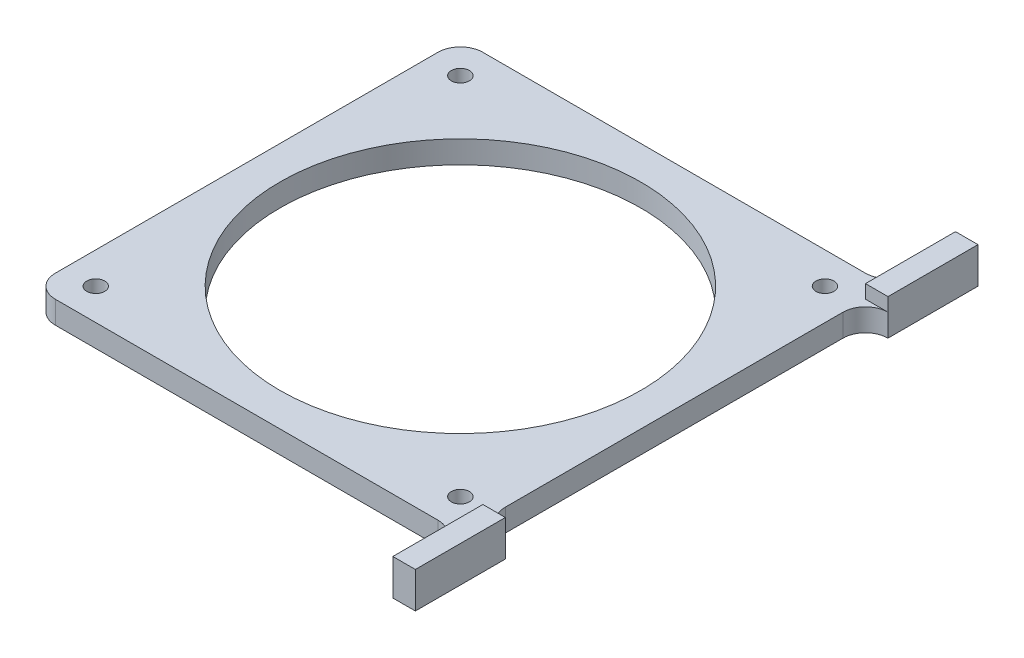
ISO-10303-21;
HEADER;
FILE_DESCRIPTION(('STEP AP214'),'2;1');
FILE_NAME('part.step','',(''),(''),'','','');
FILE_SCHEMA(('AUTOMOTIVE_DESIGN { 1 0 10303 214 1 1 1 1 }'));
ENDSEC;
DATA;
#1=APPLICATION_CONTEXT('core data for automotive mechanical design processes');
#2=APPLICATION_PROTOCOL_DEFINITION('international standard','automotive_design',2000,#1);
#3=PRODUCT_CONTEXT('',#1,'mechanical');
#4=PRODUCT('Part','Part','',(#3));
#5=PRODUCT_RELATED_PRODUCT_CATEGORY('part','',(#4));
#6=PRODUCT_DEFINITION_FORMATION('','',#4);
#7=PRODUCT_DEFINITION_CONTEXT('part definition',#1,'design');
#8=PRODUCT_DEFINITION('design','',#6,#7);
#9=PRODUCT_DEFINITION_SHAPE('','',#8);
#10=(LENGTH_UNIT() NAMED_UNIT(*) SI_UNIT(.MILLI.,.METRE.));
#11=(NAMED_UNIT(*) PLANE_ANGLE_UNIT() SI_UNIT($,.RADIAN.));
#12=(NAMED_UNIT(*) SI_UNIT($,.STERADIAN.) SOLID_ANGLE_UNIT());
#13=UNCERTAINTY_MEASURE_WITH_UNIT(LENGTH_MEASURE(1.E-05),#10,'distance_accuracy_value','');
#14=(GEOMETRIC_REPRESENTATION_CONTEXT(3) GLOBAL_UNCERTAINTY_ASSIGNED_CONTEXT((#13)) GLOBAL_UNIT_ASSIGNED_CONTEXT((#10,
#11,#12)) REPRESENTATION_CONTEXT('',''));
#15=CARTESIAN_POINT('',(0.,0.,0.));
#16=DIRECTION('',(0.,0.,1.));
#17=DIRECTION('',(1.,0.,0.));
#18=AXIS2_PLACEMENT_3D('',#15,#16,#17);
#19=CARTESIAN_POINT('',(0.,5.,0.));
#20=DIRECTION('',(0.,1.,0.));
#21=DIRECTION('',(0.,0.,1.));
#22=AXIS2_PLACEMENT_3D('',#19,#20,#21);
#23=PLANE('',#22);
#24=CARTESIAN_POINT('',(-40.5,5.,40.5));
#25=DIRECTION('',(0.,-1.,0.));
#26=DIRECTION('',(0.,0.,-1.));
#27=AXIS2_PLACEMENT_3D('',#24,#25,#26);
#28=CIRCLE('',#27,2.);
#29=CARTESIAN_POINT('',(-40.5,5.,38.5));
#30=VERTEX_POINT('',#29);
#31=EDGE_CURVE('E248',#30,#30,#28,.T.);
#32=ORIENTED_EDGE('',*,*,#31,.T.);
#33=EDGE_LOOP('',(#32));
#34=FACE_BOUND('',#33,.T.);
#35=CARTESIAN_POINT('',(40.5,5.,40.5));
#36=DIRECTION('',(0.,-1.,0.));
#37=DIRECTION('',(0.,0.,-1.));
#38=AXIS2_PLACEMENT_3D('',#35,#36,#37);
#39=CIRCLE('',#38,2.);
#40=CARTESIAN_POINT('',(40.5,5.,38.5));
#41=VERTEX_POINT('',#40);
#42=EDGE_CURVE('E254',#41,#41,#39,.T.);
#43=ORIENTED_EDGE('',*,*,#42,.T.);
#44=EDGE_LOOP('',(#43));
#45=FACE_BOUND('',#44,.T.);
#46=CARTESIAN_POINT('',(40.5,5.,-40.5));
#47=DIRECTION('',(0.,-1.,0.));
#48=DIRECTION('',(0.,0.,-1.));
#49=AXIS2_PLACEMENT_3D('',#46,#47,#48);
#50=CIRCLE('',#49,2.);
#51=CARTESIAN_POINT('',(40.5,5.,-42.5));
#52=VERTEX_POINT('',#51);
#53=EDGE_CURVE('E260',#52,#52,#50,.T.);
#54=ORIENTED_EDGE('',*,*,#53,.T.);
#55=EDGE_LOOP('',(#54));
#56=FACE_BOUND('',#55,.T.);
#57=CARTESIAN_POINT('',(-40.5,5.,-40.5));
#58=DIRECTION('',(0.,-1.,0.));
#59=DIRECTION('',(0.,0.,-1.));
#60=AXIS2_PLACEMENT_3D('',#57,#58,#59);
#61=CIRCLE('',#60,2.);
#62=CARTESIAN_POINT('',(-40.5,5.,-42.5));
#63=VERTEX_POINT('',#62);
#64=EDGE_CURVE('E266',#63,#63,#61,.T.);
#65=ORIENTED_EDGE('',*,*,#64,.T.);
#66=EDGE_LOOP('',(#65));
#67=FACE_BOUND('',#66,.T.);
#68=CARTESIAN_POINT('',(0.,5.,0.));
#69=DIRECTION('',(0.,1.,0.));
#70=DIRECTION('',(0.,0.,1.));
#71=AXIS2_PLACEMENT_3D('',#68,#69,#70);
#72=CIRCLE('',#71,40.1);
#73=CARTESIAN_POINT('',(0.,5.,40.1));
#74=VERTEX_POINT('',#73);
#75=EDGE_CURVE('E270',#74,#74,#72,.T.);
#76=ORIENTED_EDGE('',*,*,#75,.F.);
#77=EDGE_LOOP('',(#76));
#78=FACE_BOUND('',#77,.T.);
#79=DIRECTION('',(1.,0.,0.));
#80=VECTOR('',#79,1.);
#81=CARTESIAN_POINT('',(0.,5.,-47.5));
#82=LINE('',#81,#80);
#83=CARTESIAN_POINT('',(-42.5,5.,-47.5));
#84=VERTEX_POINT('',#83);
#85=CARTESIAN_POINT('',(42.5,5.,-47.5));
#86=VERTEX_POINT('',#85);
#87=EDGE_CURVE('E280',#84,#86,#82,.T.);
#88=ORIENTED_EDGE('',*,*,#87,.F.);
#89=CARTESIAN_POINT('',(-42.5,5.,-42.5));
#90=DIRECTION('',(0.,1.,0.));
#91=DIRECTION('',(0.,0.,1.));
#92=AXIS2_PLACEMENT_3D('',#89,#90,#91);
#93=CIRCLE('',#92,5.);
#94=CARTESIAN_POINT('',(-47.5,5.,-42.5));
#95=VERTEX_POINT('',#94);
#96=EDGE_CURVE('E61',#84,#95,#93,.T.);
#97=ORIENTED_EDGE('',*,*,#96,.T.);
#98=DIRECTION('',(0.,0.,-1.));
#99=VECTOR('',#98,1.);
#100=CARTESIAN_POINT('',(-47.5,5.,0.));
#101=LINE('',#100,#99);
#102=CARTESIAN_POINT('',(-47.5,5.,42.5));
#103=VERTEX_POINT('',#102);
#104=EDGE_CURVE('E283',#103,#95,#101,.T.);
#105=ORIENTED_EDGE('',*,*,#104,.F.);
#106=CARTESIAN_POINT('',(-42.5,5.,42.5));
#107=DIRECTION('',(0.,1.,0.));
#108=DIRECTION('',(0.,0.,1.));
#109=AXIS2_PLACEMENT_3D('',#106,#107,#108);
#110=CIRCLE('',#109,5.);
#111=CARTESIAN_POINT('',(-42.5,5.,47.5));
#112=VERTEX_POINT('',#111);
#113=EDGE_CURVE('E330',#103,#112,#110,.T.);
#114=ORIENTED_EDGE('',*,*,#113,.T.);
#115=DIRECTION('',(1.,0.,0.));
#116=VECTOR('',#115,1.);
#117=CARTESIAN_POINT('',(0.,5.,47.5));
#118=LINE('',#117,#116);
#119=CARTESIAN_POINT('',(42.5,5.,47.5));
#120=VERTEX_POINT('',#119);
#121=EDGE_CURVE('E273',#112,#120,#118,.T.);
#122=ORIENTED_EDGE('',*,*,#121,.T.);
#123=CARTESIAN_POINT('',(42.5,5.,52.5));
#124=DIRECTION('',(0.,1.,0.));
#125=DIRECTION('',(0.,0.,1.));
#126=AXIS2_PLACEMENT_3D('',#123,#124,#125);
#127=CIRCLE('',#126,5.);
#128=CARTESIAN_POINT('',(47.5,5.,52.5));
#129=VERTEX_POINT('',#128);
#130=EDGE_CURVE('E335',#120,#129,#127,.F.);
#131=ORIENTED_EDGE('',*,*,#130,.T.);
#132=DIRECTION('',(0.,0.,1.));
#133=VECTOR('',#132,1.);
#134=CARTESIAN_POINT('',(47.5,5.,62.5));
#135=LINE('',#134,#133);
#136=CARTESIAN_POINT('',(47.5,5.,42.5));
#137=VERTEX_POINT('',#136);
#138=EDGE_CURVE('E195',#137,#129,#135,.T.);
#139=ORIENTED_EDGE('',*,*,#138,.F.);
#140=DIRECTION('',(-1.,0.,0.));
#141=VECTOR('',#140,1.);
#142=CARTESIAN_POINT('',(47.5,5.,42.5));
#143=LINE('',#142,#141);
#144=CARTESIAN_POINT('',(52.5,5.,42.5));
#145=VERTEX_POINT('',#144);
#146=EDGE_CURVE('E311',#145,#137,#143,.T.);
#147=ORIENTED_EDGE('',*,*,#146,.F.);
#148=CARTESIAN_POINT('',(52.5,5.,37.5));
#149=DIRECTION('',(0.,1.,0.));
#150=DIRECTION('',(0.,0.,1.));
#151=AXIS2_PLACEMENT_3D('',#148,#149,#150);
#152=CIRCLE('',#151,5.);
#153=CARTESIAN_POINT('',(47.5,5.,37.5));
#154=VERTEX_POINT('',#153);
#155=EDGE_CURVE('E340',#145,#154,#152,.F.);
#156=ORIENTED_EDGE('',*,*,#155,.T.);
#157=DIRECTION('',(0.,0.,-1.));
#158=VECTOR('',#157,1.);
#159=CARTESIAN_POINT('',(47.5,5.,0.));
#160=LINE('',#159,#158);
#161=CARTESIAN_POINT('',(47.5,5.,-37.5));
#162=VERTEX_POINT('',#161);
#163=EDGE_CURVE('E277',#154,#162,#160,.T.);
#164=ORIENTED_EDGE('',*,*,#163,.T.);
#165=CARTESIAN_POINT('',(52.5,5.,-37.5));
#166=DIRECTION('',(0.,1.,0.));
#167=DIRECTION('',(0.,0.,1.));
#168=AXIS2_PLACEMENT_3D('',#165,#166,#167);
#169=CIRCLE('',#168,5.);
#170=CARTESIAN_POINT('',(52.5,5.,-42.5));
#171=VERTEX_POINT('',#170);
#172=EDGE_CURVE('E344',#162,#171,#169,.F.);
#173=ORIENTED_EDGE('',*,*,#172,.T.);
#174=DIRECTION('',(1.,0.,0.));
#175=VECTOR('',#174,1.);
#176=CARTESIAN_POINT('',(47.5,5.,-42.5));
#177=LINE('',#176,#175);
#178=CARTESIAN_POINT('',(47.5,5.,-42.5));
#179=VERTEX_POINT('',#178);
#180=EDGE_CURVE('E54',#179,#171,#177,.T.);
#181=ORIENTED_EDGE('',*,*,#180,.F.);
#182=DIRECTION('',(0.,0.,1.));
#183=VECTOR('',#182,1.);
#184=CARTESIAN_POINT('',(47.5,5.,-42.5));
#185=LINE('',#184,#183);
#186=CARTESIAN_POINT('',(47.5,5.,-52.5));
#187=VERTEX_POINT('',#186);
#188=EDGE_CURVE('E190',#187,#179,#185,.T.);
#189=ORIENTED_EDGE('',*,*,#188,.F.);
#190=CARTESIAN_POINT('',(42.5,5.,-52.5));
#191=DIRECTION('',(0.,1.,0.));
#192=DIRECTION('',(0.,0.,1.));
#193=AXIS2_PLACEMENT_3D('',#190,#191,#192);
#194=CIRCLE('',#193,5.);
#195=EDGE_CURVE('E11',#187,#86,#194,.F.);
#196=ORIENTED_EDGE('',*,*,#195,.T.);
#197=EDGE_LOOP('',(#88,#97,#105,#114,#122,#131,#139,#147,#156,#164,#173,#181,#189,#196));
#198=FACE_BOUND('',#197,.T.);
#199=ADVANCED_FACE('F39',(#34,#45,#56,#67,#78,#198),#23,.T.);
#200=CARTESIAN_POINT('',(47.5,5.,0.));
#201=DIRECTION('',(-1.,0.,0.));
#202=DIRECTION('',(0.,0.,1.));
#203=AXIS2_PLACEMENT_3D('',#200,#201,#202);
#204=PLANE('',#203);
#205=ORIENTED_EDGE('',*,*,#163,.F.);
#206=DIRECTION('',(0.,-1.,0.));
#207=VECTOR('',#206,1.);
#208=CARTESIAN_POINT('',(47.5,0.,37.5));
#209=LINE('',#208,#207);
#210=CARTESIAN_POINT('',(47.5,0.,37.5));
#211=VERTEX_POINT('',#210);
#212=EDGE_CURVE('E308',#154,#211,#209,.T.);
#213=ORIENTED_EDGE('',*,*,#212,.T.);
#214=DIRECTION('',(0.,0.,-1.));
#215=VECTOR('',#214,1.);
#216=CARTESIAN_POINT('',(47.5,0.,0.));
#217=LINE('',#216,#215);
#218=CARTESIAN_POINT('',(47.5,0.,-37.5));
#219=VERTEX_POINT('',#218);
#220=EDGE_CURVE('E291',#211,#219,#217,.T.);
#221=ORIENTED_EDGE('',*,*,#220,.T.);
#222=DIRECTION('',(0.,-1.,0.));
#223=VECTOR('',#222,1.);
#224=CARTESIAN_POINT('',(47.5,5.,-37.5));
#225=LINE('',#224,#223);
#226=EDGE_CURVE('E306',#219,#162,#225,.F.);
#227=ORIENTED_EDGE('',*,*,#226,.T.);
#228=EDGE_LOOP('',(#205,#213,#221,#227));
#229=FACE_BOUND('',#228,.T.);
#230=ADVANCED_FACE('F405',(#229),#204,.F.);
#231=CARTESIAN_POINT('',(0.,5.,47.5));
#232=DIRECTION('',(0.,0.,-1.));
#233=DIRECTION('',(-1.,0.,0.));
#234=AXIS2_PLACEMENT_3D('',#231,#232,#233);
#235=PLANE('',#234);
#236=DIRECTION('',(1.,0.,0.));
#237=VECTOR('',#236,1.);
#238=CARTESIAN_POINT('',(0.,0.,47.5));
#239=LINE('',#238,#237);
#240=CARTESIAN_POINT('',(-42.5,0.,47.5));
#241=VERTEX_POINT('',#240);
#242=CARTESIAN_POINT('',(42.5,0.,47.5));
#243=VERTEX_POINT('',#242);
#244=EDGE_CURVE('E288',#241,#243,#239,.T.);
#245=ORIENTED_EDGE('',*,*,#244,.T.);
#246=DIRECTION('',(0.,-1.,0.));
#247=VECTOR('',#246,1.);
#248=CARTESIAN_POINT('',(42.5,5.,47.5));
#249=LINE('',#248,#247);
#250=EDGE_CURVE('E304',#243,#120,#249,.F.);
#251=ORIENTED_EDGE('',*,*,#250,.T.);
#252=ORIENTED_EDGE('',*,*,#121,.F.);
#253=DIRECTION('',(0.,-1.,0.));
#254=VECTOR('',#253,1.);
#255=CARTESIAN_POINT('',(-42.5,0.,47.5));
#256=LINE('',#255,#254);
#257=EDGE_CURVE('E301',#112,#241,#256,.T.);
#258=ORIENTED_EDGE('',*,*,#257,.T.);
#259=EDGE_LOOP('',(#245,#251,#252,#258));
#260=FACE_BOUND('',#259,.T.);
#261=ADVANCED_FACE('F371',(#260),#235,.F.);
#262=CARTESIAN_POINT('',(0.,5.,-47.5));
#263=DIRECTION('',(0.,0.,-1.));
#264=DIRECTION('',(-1.,0.,0.));
#265=AXIS2_PLACEMENT_3D('',#262,#263,#264);
#266=PLANE('',#265);
#267=ORIENTED_EDGE('',*,*,#87,.T.);
#268=DIRECTION('',(0.,-1.,0.));
#269=VECTOR('',#268,1.);
#270=CARTESIAN_POINT('',(42.5,5.,-47.5));
#271=LINE('',#270,#269);
#272=CARTESIAN_POINT('',(42.5,0.,-47.5));
#273=VERTEX_POINT('',#272);
#274=EDGE_CURVE('E316',#86,#273,#271,.T.);
#275=ORIENTED_EDGE('',*,*,#274,.T.);
#276=DIRECTION('',(1.,0.,0.));
#277=VECTOR('',#276,1.);
#278=CARTESIAN_POINT('',(0.,0.,-47.5));
#279=LINE('',#278,#277);
#280=CARTESIAN_POINT('',(-42.5,0.,-47.5));
#281=VERTEX_POINT('',#280);
#282=EDGE_CURVE('E294',#281,#273,#279,.T.);
#283=ORIENTED_EDGE('',*,*,#282,.F.);
#284=DIRECTION('',(0.,-1.,0.));
#285=VECTOR('',#284,1.);
#286=CARTESIAN_POINT('',(-42.5,5.,-47.5));
#287=LINE('',#286,#285);
#288=EDGE_CURVE('E314',#281,#84,#287,.F.);
#289=ORIENTED_EDGE('',*,*,#288,.T.);
#290=EDGE_LOOP('',(#267,#275,#283,#289));
#291=FACE_BOUND('',#290,.T.);
#292=ADVANCED_FACE('F356',(#291),#266,.T.);
#293=CARTESIAN_POINT('',(0.,5.,0.));
#294=DIRECTION('',(0.,-1.,0.));
#295=DIRECTION('',(0.,0.,-1.));
#296=AXIS2_PLACEMENT_3D('',#293,#294,#295);
#297=CYLINDRICAL_SURFACE('',#296,40.1);
#298=ORIENTED_EDGE('',*,*,#75,.T.);
#299=EDGE_LOOP('',(#298));
#300=FACE_BOUND('',#299,.T.);
#301=CARTESIAN_POINT('',(0.,0.,0.));
#302=DIRECTION('',(0.,1.,0.));
#303=DIRECTION('',(0.,0.,1.));
#304=AXIS2_PLACEMENT_3D('',#301,#302,#303);
#305=CIRCLE('',#304,40.1);
#306=CARTESIAN_POINT('',(0.,0.,40.1));
#307=VERTEX_POINT('',#306);
#308=EDGE_CURVE('E269',#307,#307,#305,.T.);
#309=ORIENTED_EDGE('',*,*,#308,.F.);
#310=EDGE_LOOP('',(#309));
#311=FACE_BOUND('',#310,.T.);
#312=ADVANCED_FACE('F443',(#300,#311),#297,.F.);
#313=CARTESIAN_POINT('',(-47.5,5.,0.));
#314=DIRECTION('',(-1.,0.,0.));
#315=DIRECTION('',(0.,0.,1.));
#316=AXIS2_PLACEMENT_3D('',#313,#314,#315);
#317=PLANE('',#316);
#318=ORIENTED_EDGE('',*,*,#104,.T.);
#319=DIRECTION('',(0.,-1.,0.));
#320=VECTOR('',#319,1.);
#321=CARTESIAN_POINT('',(-47.5,5.,-42.5));
#322=LINE('',#321,#320);
#323=CARTESIAN_POINT('',(-47.5,0.,-42.5));
#324=VERTEX_POINT('',#323);
#325=EDGE_CURVE('E323',#95,#324,#322,.T.);
#326=ORIENTED_EDGE('',*,*,#325,.T.);
#327=DIRECTION('',(0.,0.,-1.));
#328=VECTOR('',#327,1.);
#329=CARTESIAN_POINT('',(-47.5,0.,0.));
#330=LINE('',#329,#328);
#331=CARTESIAN_POINT('',(-47.5,0.,42.5));
#332=VERTEX_POINT('',#331);
#333=EDGE_CURVE('E274',#332,#324,#330,.T.);
#334=ORIENTED_EDGE('',*,*,#333,.F.);
#335=DIRECTION('',(0.,-1.,0.));
#336=VECTOR('',#335,1.);
#337=CARTESIAN_POINT('',(-47.5,5.,42.5));
#338=LINE('',#337,#336);
#339=EDGE_CURVE('E321',#332,#103,#338,.F.);
#340=ORIENTED_EDGE('',*,*,#339,.T.);
#341=EDGE_LOOP('',(#318,#326,#334,#340));
#342=FACE_BOUND('',#341,.T.);
#343=ADVANCED_FACE('F363',(#342),#317,.T.);
#344=CARTESIAN_POINT('',(0.,0.,0.));
#345=DIRECTION('',(0.,1.,0.));
#346=DIRECTION('',(0.,0.,1.));
#347=AXIS2_PLACEMENT_3D('',#344,#345,#346);
#348=PLANE('',#347);
#349=CARTESIAN_POINT('',(-40.5,0.,40.5));
#350=DIRECTION('',(0.,-1.,0.));
#351=DIRECTION('',(0.,0.,-1.));
#352=AXIS2_PLACEMENT_3D('',#349,#350,#351);
#353=CIRCLE('',#352,1.99999999999999);
#354=CARTESIAN_POINT('',(-40.5,0.,38.5));
#355=VERTEX_POINT('',#354);
#356=EDGE_CURVE('E245',#355,#355,#353,.T.);
#357=ORIENTED_EDGE('',*,*,#356,.F.);
#358=EDGE_LOOP('',(#357));
#359=FACE_BOUND('',#358,.T.);
#360=CARTESIAN_POINT('',(40.5,0.,40.5));
#361=DIRECTION('',(0.,-1.,0.));
#362=DIRECTION('',(0.,0.,-1.));
#363=AXIS2_PLACEMENT_3D('',#360,#361,#362);
#364=CIRCLE('',#363,1.99999999999999);
#365=CARTESIAN_POINT('',(40.5,0.,38.5));
#366=VERTEX_POINT('',#365);
#367=EDGE_CURVE('E251',#366,#366,#364,.T.);
#368=ORIENTED_EDGE('',*,*,#367,.F.);
#369=EDGE_LOOP('',(#368));
#370=FACE_BOUND('',#369,.T.);
#371=CARTESIAN_POINT('',(40.5,0.,-40.5));
#372=DIRECTION('',(0.,-1.,0.));
#373=DIRECTION('',(0.,0.,-1.));
#374=AXIS2_PLACEMENT_3D('',#371,#372,#373);
#375=CIRCLE('',#374,1.99999999999999);
#376=CARTESIAN_POINT('',(40.5,0.,-42.5));
#377=VERTEX_POINT('',#376);
#378=EDGE_CURVE('E257',#377,#377,#375,.T.);
#379=ORIENTED_EDGE('',*,*,#378,.F.);
#380=EDGE_LOOP('',(#379));
#381=FACE_BOUND('',#380,.T.);
#382=CARTESIAN_POINT('',(-40.5,0.,-40.5));
#383=DIRECTION('',(0.,-1.,0.));
#384=DIRECTION('',(0.,0.,-1.));
#385=AXIS2_PLACEMENT_3D('',#382,#383,#384);
#386=CIRCLE('',#385,1.99999999999999);
#387=CARTESIAN_POINT('',(-40.5,0.,-42.5));
#388=VERTEX_POINT('',#387);
#389=EDGE_CURVE('E263',#388,#388,#386,.T.);
#390=ORIENTED_EDGE('',*,*,#389,.F.);
#391=EDGE_LOOP('',(#390));
#392=FACE_BOUND('',#391,.T.);
#393=ORIENTED_EDGE('',*,*,#308,.T.);
#394=EDGE_LOOP('',(#393));
#395=FACE_BOUND('',#394,.T.);
#396=ORIENTED_EDGE('',*,*,#333,.T.);
#397=CARTESIAN_POINT('',(-42.5,0.,-42.5));
#398=DIRECTION('',(0.,1.,0.));
#399=DIRECTION('',(0.,0.,1.));
#400=AXIS2_PLACEMENT_3D('',#397,#398,#399);
#401=CIRCLE('',#400,5.);
#402=EDGE_CURVE('E328',#324,#281,#401,.F.);
#403=ORIENTED_EDGE('',*,*,#402,.T.);
#404=ORIENTED_EDGE('',*,*,#282,.T.);
#405=CARTESIAN_POINT('',(42.5,0.,-52.5));
#406=DIRECTION('',(0.,1.,0.));
#407=DIRECTION('',(0.,0.,1.));
#408=AXIS2_PLACEMENT_3D('',#405,#406,#407);
#409=CIRCLE('',#408,5.);
#410=CARTESIAN_POINT('',(47.5,0.,-52.5));
#411=VERTEX_POINT('',#410);
#412=EDGE_CURVE('E47',#273,#411,#409,.T.);
#413=ORIENTED_EDGE('',*,*,#412,.T.);
#414=DIRECTION('',(0.,0.,1.));
#415=VECTOR('',#414,1.);
#416=CARTESIAN_POINT('',(47.5,0.,-42.5));
#417=LINE('',#416,#415);
#418=CARTESIAN_POINT('',(47.5,0.,-62.5));
#419=VERTEX_POINT('',#418);
#420=EDGE_CURVE('E215',#419,#411,#417,.T.);
#421=ORIENTED_EDGE('',*,*,#420,.F.);
#422=DIRECTION('',(-1.,0.,0.));
#423=VECTOR('',#422,1.);
#424=CARTESIAN_POINT('',(47.5,0.,-62.5));
#425=LINE('',#424,#423);
#426=CARTESIAN_POINT('',(52.5,0.,-62.5));
#427=VERTEX_POINT('',#426);
#428=EDGE_CURVE('E219',#427,#419,#425,.T.);
#429=ORIENTED_EDGE('',*,*,#428,.F.);
#430=DIRECTION('',(0.,0.,-1.));
#431=VECTOR('',#430,1.);
#432=CARTESIAN_POINT('',(52.5,0.,-42.5));
#433=LINE('',#432,#431);
#434=CARTESIAN_POINT('',(52.5,0.,-42.5));
#435=VERTEX_POINT('',#434);
#436=EDGE_CURVE('E217',#435,#427,#433,.T.);
#437=ORIENTED_EDGE('',*,*,#436,.F.);
#438=CARTESIAN_POINT('',(52.5,0.,-37.5));
#439=DIRECTION('',(0.,1.,0.));
#440=DIRECTION('',(0.,0.,1.));
#441=AXIS2_PLACEMENT_3D('',#438,#439,#440);
#442=CIRCLE('',#441,5.);
#443=EDGE_CURVE('E342',#435,#219,#442,.T.);
#444=ORIENTED_EDGE('',*,*,#443,.T.);
#445=ORIENTED_EDGE('',*,*,#220,.F.);
#446=CARTESIAN_POINT('',(52.5,0.,37.5));
#447=DIRECTION('',(0.,1.,0.));
#448=DIRECTION('',(0.,0.,1.));
#449=AXIS2_PLACEMENT_3D('',#446,#447,#448);
#450=CIRCLE('',#449,5.);
#451=CARTESIAN_POINT('',(52.5,0.,42.5));
#452=VERTEX_POINT('',#451);
#453=EDGE_CURVE('E338',#211,#452,#450,.T.);
#454=ORIENTED_EDGE('',*,*,#453,.T.);
#455=DIRECTION('',(0.,0.,-1.));
#456=VECTOR('',#455,1.);
#457=CARTESIAN_POINT('',(52.5,0.,42.5));
#458=LINE('',#457,#456);
#459=CARTESIAN_POINT('',(52.5,0.,62.5));
#460=VERTEX_POINT('',#459);
#461=EDGE_CURVE('E232',#460,#452,#458,.T.);
#462=ORIENTED_EDGE('',*,*,#461,.F.);
#463=DIRECTION('',(1.,0.,0.));
#464=VECTOR('',#463,1.);
#465=CARTESIAN_POINT('',(47.5,0.,62.5));
#466=LINE('',#465,#464);
#467=CARTESIAN_POINT('',(47.5,0.,62.5));
#468=VERTEX_POINT('',#467);
#469=EDGE_CURVE('E230',#468,#460,#466,.T.);
#470=ORIENTED_EDGE('',*,*,#469,.F.);
#471=DIRECTION('',(0.,0.,1.));
#472=VECTOR('',#471,1.);
#473=CARTESIAN_POINT('',(47.5,0.,42.5));
#474=LINE('',#473,#472);
#475=CARTESIAN_POINT('',(47.5,0.,52.5));
#476=VERTEX_POINT('',#475);
#477=EDGE_CURVE('E228',#476,#468,#474,.T.);
#478=ORIENTED_EDGE('',*,*,#477,.F.);
#479=CARTESIAN_POINT('',(42.5,0.,52.5));
#480=DIRECTION('',(0.,1.,0.));
#481=DIRECTION('',(0.,0.,1.));
#482=AXIS2_PLACEMENT_3D('',#479,#480,#481);
#483=CIRCLE('',#482,5.);
#484=EDGE_CURVE('E333',#476,#243,#483,.T.);
#485=ORIENTED_EDGE('',*,*,#484,.T.);
#486=ORIENTED_EDGE('',*,*,#244,.F.);
#487=CARTESIAN_POINT('',(-42.5,0.,42.5));
#488=DIRECTION('',(0.,1.,0.));
#489=DIRECTION('',(0.,0.,1.));
#490=AXIS2_PLACEMENT_3D('',#487,#488,#489);
#491=CIRCLE('',#490,5.);
#492=EDGE_CURVE('E326',#241,#332,#491,.F.);
#493=ORIENTED_EDGE('',*,*,#492,.T.);
#494=EDGE_LOOP('',(#396,#403,#404,#413,#421,#429,#437,#444,#445,#454,#462,#470,#478,#485,#486,#493));
#495=FACE_BOUND('',#494,.T.);
#496=ADVANCED_FACE('F347',(#359,#370,#381,#392,#395,#495),#348,.F.);
#497=CARTESIAN_POINT('',(-40.5,0.,-40.5));
#498=DIRECTION('',(0.,-1.,0.));
#499=DIRECTION('',(0.,0.,-1.));
#500=AXIS2_PLACEMENT_3D('',#497,#498,#499);
#501=CYLINDRICAL_SURFACE('',#500,1.99999999999999);
#502=ORIENTED_EDGE('',*,*,#64,.F.);
#503=EDGE_LOOP('',(#502));
#504=FACE_BOUND('',#503,.T.);
#505=ORIENTED_EDGE('',*,*,#389,.T.);
#506=EDGE_LOOP('',(#505));
#507=FACE_BOUND('',#506,.T.);
#508=ADVANCED_FACE('F436',(#504,#507),#501,.F.);
#509=CARTESIAN_POINT('',(40.5,0.,-40.5));
#510=DIRECTION('',(0.,-1.,0.));
#511=DIRECTION('',(0.,0.,-1.));
#512=AXIS2_PLACEMENT_3D('',#509,#510,#511);
#513=CYLINDRICAL_SURFACE('',#512,1.99999999999999);
#514=ORIENTED_EDGE('',*,*,#53,.F.);
#515=EDGE_LOOP('',(#514));
#516=FACE_BOUND('',#515,.T.);
#517=ORIENTED_EDGE('',*,*,#378,.T.);
#518=EDGE_LOOP('',(#517));
#519=FACE_BOUND('',#518,.T.);
#520=ADVANCED_FACE('F631',(#516,#519),#513,.F.);
#521=CARTESIAN_POINT('',(40.5,0.,40.5));
#522=DIRECTION('',(0.,-1.,0.));
#523=DIRECTION('',(0.,0.,-1.));
#524=AXIS2_PLACEMENT_3D('',#521,#522,#523);
#525=CYLINDRICAL_SURFACE('',#524,1.99999999999999);
#526=ORIENTED_EDGE('',*,*,#42,.F.);
#527=EDGE_LOOP('',(#526));
#528=FACE_BOUND('',#527,.T.);
#529=ORIENTED_EDGE('',*,*,#367,.T.);
#530=EDGE_LOOP('',(#529));
#531=FACE_BOUND('',#530,.T.);
#532=ADVANCED_FACE('F621',(#528,#531),#525,.F.);
#533=CARTESIAN_POINT('',(-40.5,0.,40.5));
#534=DIRECTION('',(0.,-1.,0.));
#535=DIRECTION('',(0.,0.,-1.));
#536=AXIS2_PLACEMENT_3D('',#533,#534,#535);
#537=CYLINDRICAL_SURFACE('',#536,1.99999999999999);
#538=ORIENTED_EDGE('',*,*,#31,.F.);
#539=EDGE_LOOP('',(#538));
#540=FACE_BOUND('',#539,.T.);
#541=ORIENTED_EDGE('',*,*,#356,.T.);
#542=EDGE_LOOP('',(#541));
#543=FACE_BOUND('',#542,.T.);
#544=ADVANCED_FACE('F549',(#540,#543),#537,.F.);
#545=CARTESIAN_POINT('',(47.5,5.,42.5));
#546=DIRECTION('',(1.,0.,0.));
#547=DIRECTION('',(0.,0.,-1.));
#548=AXIS2_PLACEMENT_3D('',#545,#546,#547);
#549=PLANE('',#548);
#550=ORIENTED_EDGE('',*,*,#138,.T.);
#551=DIRECTION('',(0.,-1.,0.));
#552=VECTOR('',#551,1.);
#553=CARTESIAN_POINT('',(47.5,0.,52.5));
#554=LINE('',#553,#552);
#555=EDGE_CURVE('E285',#129,#476,#554,.T.);
#556=ORIENTED_EDGE('',*,*,#555,.T.);
#557=ORIENTED_EDGE('',*,*,#477,.T.);
#558=DIRECTION('',(0.,-1.,0.));
#559=VECTOR('',#558,1.);
#560=CARTESIAN_POINT('',(47.5,5.,62.5));
#561=LINE('',#560,#559);
#562=CARTESIAN_POINT('',(47.5,8.,62.5));
#563=VERTEX_POINT('',#562);
#564=EDGE_CURVE('E242',#563,#468,#561,.T.);
#565=ORIENTED_EDGE('',*,*,#564,.F.);
#566=DIRECTION('',(0.,0.,1.));
#567=VECTOR('',#566,1.);
#568=CARTESIAN_POINT('',(47.5,8.,62.5));
#569=LINE('',#568,#567);
#570=CARTESIAN_POINT('',(47.5,8.,42.5));
#571=VERTEX_POINT('',#570);
#572=EDGE_CURVE('E197',#571,#563,#569,.T.);
#573=ORIENTED_EDGE('',*,*,#572,.F.);
#574=DIRECTION('',(0.,-1.,0.));
#575=VECTOR('',#574,1.);
#576=CARTESIAN_POINT('',(47.5,8.,42.5));
#577=LINE('',#576,#575);
#578=EDGE_CURVE('E211',#571,#137,#577,.T.);
#579=ORIENTED_EDGE('',*,*,#578,.T.);
#580=EDGE_LOOP('',(#550,#556,#557,#565,#573,#579));
#581=FACE_BOUND('',#580,.T.);
#582=ADVANCED_FACE('F380',(#581),#549,.F.);
#583=CARTESIAN_POINT('',(47.5,5.,62.5));
#584=DIRECTION('',(0.,0.,-1.));
#585=DIRECTION('',(-1.,0.,0.));
#586=AXIS2_PLACEMENT_3D('',#583,#584,#585);
#587=PLANE('',#586);
#588=ORIENTED_EDGE('',*,*,#469,.T.);
#589=DIRECTION('',(0.,-1.,0.));
#590=VECTOR('',#589,1.);
#591=CARTESIAN_POINT('',(52.5,5.,62.5));
#592=LINE('',#591,#590);
#593=CARTESIAN_POINT('',(52.5,8.,62.5));
#594=VERTEX_POINT('',#593);
#595=EDGE_CURVE('E239',#594,#460,#592,.T.);
#596=ORIENTED_EDGE('',*,*,#595,.F.);
#597=DIRECTION('',(1.,0.,0.));
#598=VECTOR('',#597,1.);
#599=CARTESIAN_POINT('',(47.5,8.,62.5));
#600=LINE('',#599,#598);
#601=EDGE_CURVE('E204',#563,#594,#600,.T.);
#602=ORIENTED_EDGE('',*,*,#601,.F.);
#603=ORIENTED_EDGE('',*,*,#564,.T.);
#604=EDGE_LOOP('',(#588,#596,#602,#603));
#605=FACE_BOUND('',#604,.T.);
#606=ADVANCED_FACE('F385',(#605),#587,.F.);
#607=CARTESIAN_POINT('',(52.5,5.,42.5));
#608=DIRECTION('',(-1.,0.,0.));
#609=DIRECTION('',(0.,0.,1.));
#610=AXIS2_PLACEMENT_3D('',#607,#608,#609);
#611=PLANE('',#610);
#612=ORIENTED_EDGE('',*,*,#461,.T.);
#613=DIRECTION('',(0.,-1.,0.));
#614=VECTOR('',#613,1.);
#615=CARTESIAN_POINT('',(52.5,5.,42.5));
#616=LINE('',#615,#614);
#617=EDGE_CURVE('E235',#145,#452,#616,.T.);
#618=ORIENTED_EDGE('',*,*,#617,.F.);
#619=CARTESIAN_POINT('',(52.5,8.,42.5));
#620=VERTEX_POINT('',#619);
#621=EDGE_CURVE('E236',#620,#145,#616,.T.);
#622=ORIENTED_EDGE('',*,*,#621,.F.);
#623=DIRECTION('',(0.,0.,-1.));
#624=VECTOR('',#623,1.);
#625=CARTESIAN_POINT('',(52.5,8.,62.5));
#626=LINE('',#625,#624);
#627=EDGE_CURVE('E207',#594,#620,#626,.T.);
#628=ORIENTED_EDGE('',*,*,#627,.F.);
#629=ORIENTED_EDGE('',*,*,#595,.T.);
#630=EDGE_LOOP('',(#612,#618,#622,#628,#629));
#631=FACE_BOUND('',#630,.T.);
#632=ADVANCED_FACE('F399',(#631),#611,.F.);
#633=CARTESIAN_POINT('',(47.5,5.,42.5));
#634=DIRECTION('',(0.,0.,1.));
#635=DIRECTION('',(1.,0.,0.));
#636=AXIS2_PLACEMENT_3D('',#633,#634,#635);
#637=PLANE('',#636);
#638=ORIENTED_EDGE('',*,*,#621,.T.);
#639=ORIENTED_EDGE('',*,*,#146,.T.);
#640=ORIENTED_EDGE('',*,*,#578,.F.);
#641=DIRECTION('',(-1.,0.,0.));
#642=VECTOR('',#641,1.);
#643=CARTESIAN_POINT('',(47.5,8.,42.5));
#644=LINE('',#643,#642);
#645=EDGE_CURVE('E210',#620,#571,#644,.T.);
#646=ORIENTED_EDGE('',*,*,#645,.F.);
#647=EDGE_LOOP('',(#638,#639,#640,#646));
#648=FACE_BOUND('',#647,.T.);
#649=ADVANCED_FACE('F393',(#648),#637,.F.);
#650=CARTESIAN_POINT('',(47.5,5.,-42.5));
#651=DIRECTION('',(1.,0.,0.));
#652=DIRECTION('',(0.,0.,-1.));
#653=AXIS2_PLACEMENT_3D('',#650,#651,#652);
#654=PLANE('',#653);
#655=ORIENTED_EDGE('',*,*,#420,.T.);
#656=DIRECTION('',(0.,-1.,0.));
#657=VECTOR('',#656,1.);
#658=CARTESIAN_POINT('',(47.5,5.,-52.5));
#659=LINE('',#658,#657);
#660=EDGE_CURVE('E319',#411,#187,#659,.F.);
#661=ORIENTED_EDGE('',*,*,#660,.T.);
#662=ORIENTED_EDGE('',*,*,#188,.T.);
#663=DIRECTION('',(0.,-1.,0.));
#664=VECTOR('',#663,1.);
#665=CARTESIAN_POINT('',(47.5,8.,-42.5));
#666=LINE('',#665,#664);
#667=CARTESIAN_POINT('',(47.5,8.,-42.5));
#668=VERTEX_POINT('',#667);
#669=EDGE_CURVE('E173',#668,#179,#666,.T.);
#670=ORIENTED_EDGE('',*,*,#669,.F.);
#671=DIRECTION('',(0.,0.,1.));
#672=VECTOR('',#671,1.);
#673=CARTESIAN_POINT('',(47.5,8.,-42.5));
#674=LINE('',#673,#672);
#675=CARTESIAN_POINT('',(47.5,8.,-62.5));
#676=VERTEX_POINT('',#675);
#677=EDGE_CURVE('E181',#676,#668,#674,.T.);
#678=ORIENTED_EDGE('',*,*,#677,.F.);
#679=DIRECTION('',(0.,-1.,0.));
#680=VECTOR('',#679,1.);
#681=CARTESIAN_POINT('',(47.5,5.,-62.5));
#682=LINE('',#681,#680);
#683=EDGE_CURVE('E221',#676,#419,#682,.T.);
#684=ORIENTED_EDGE('',*,*,#683,.T.);
#685=EDGE_LOOP('',(#655,#661,#662,#670,#678,#684));
#686=FACE_BOUND('',#685,.T.);
#687=ADVANCED_FACE('F193',(#686),#654,.F.);
#688=CARTESIAN_POINT('',(47.5,5.,-42.5));
#689=DIRECTION('',(0.,0.,-1.));
#690=DIRECTION('',(-1.,0.,0.));
#691=AXIS2_PLACEMENT_3D('',#688,#689,#690);
#692=PLANE('',#691);
#693=ORIENTED_EDGE('',*,*,#669,.T.);
#694=ORIENTED_EDGE('',*,*,#180,.T.);
#695=DIRECTION('',(0.,-1.,0.));
#696=VECTOR('',#695,1.);
#697=CARTESIAN_POINT('',(52.5,5.,-42.5));
#698=LINE('',#697,#696);
#699=CARTESIAN_POINT('',(52.5,8.,-42.5));
#700=VERTEX_POINT('',#699);
#701=EDGE_CURVE('E176',#700,#171,#698,.T.);
#702=ORIENTED_EDGE('',*,*,#701,.F.);
#703=DIRECTION('',(1.,0.,0.));
#704=VECTOR('',#703,1.);
#705=CARTESIAN_POINT('',(47.5,8.,-42.5));
#706=LINE('',#705,#704);
#707=EDGE_CURVE('E169',#668,#700,#706,.T.);
#708=ORIENTED_EDGE('',*,*,#707,.F.);
#709=EDGE_LOOP('',(#693,#694,#702,#708));
#710=FACE_BOUND('',#709,.T.);
#711=ADVANCED_FACE('F171',(#710),#692,.F.);
#712=CARTESIAN_POINT('',(52.5,5.,-42.5));
#713=DIRECTION('',(-1.,0.,0.));
#714=DIRECTION('',(0.,0.,1.));
#715=AXIS2_PLACEMENT_3D('',#712,#713,#714);
#716=PLANE('',#715);
#717=ORIENTED_EDGE('',*,*,#436,.T.);
#718=DIRECTION('',(0.,-1.,0.));
#719=VECTOR('',#718,1.);
#720=CARTESIAN_POINT('',(52.5,5.,-62.5));
#721=LINE('',#720,#719);
#722=CARTESIAN_POINT('',(52.5,8.,-62.5));
#723=VERTEX_POINT('',#722);
#724=EDGE_CURVE('E223',#723,#427,#721,.T.);
#725=ORIENTED_EDGE('',*,*,#724,.F.);
#726=DIRECTION('',(0.,0.,-1.));
#727=VECTOR('',#726,1.);
#728=CARTESIAN_POINT('',(52.5,8.,-42.5));
#729=LINE('',#728,#727);
#730=EDGE_CURVE('E180',#700,#723,#729,.T.);
#731=ORIENTED_EDGE('',*,*,#730,.F.);
#732=ORIENTED_EDGE('',*,*,#701,.T.);
#733=EDGE_CURVE('E226',#171,#435,#698,.T.);
#734=ORIENTED_EDGE('',*,*,#733,.T.);
#735=EDGE_LOOP('',(#717,#725,#731,#732,#734));
#736=FACE_BOUND('',#735,.T.);
#737=ADVANCED_FACE('F414',(#736),#716,.F.);
#738=CARTESIAN_POINT('',(47.5,5.,-62.5));
#739=DIRECTION('',(0.,0.,1.));
#740=DIRECTION('',(1.,0.,0.));
#741=AXIS2_PLACEMENT_3D('',#738,#739,#740);
#742=PLANE('',#741);
#743=ORIENTED_EDGE('',*,*,#428,.T.);
#744=ORIENTED_EDGE('',*,*,#683,.F.);
#745=DIRECTION('',(-1.,0.,0.));
#746=VECTOR('',#745,1.);
#747=CARTESIAN_POINT('',(47.5,8.,-62.5));
#748=LINE('',#747,#746);
#749=EDGE_CURVE('E187',#723,#676,#748,.T.);
#750=ORIENTED_EDGE('',*,*,#749,.F.);
#751=ORIENTED_EDGE('',*,*,#724,.T.);
#752=EDGE_LOOP('',(#743,#744,#750,#751));
#753=FACE_BOUND('',#752,.T.);
#754=ADVANCED_FACE('F417',(#753),#742,.F.);
#755=CARTESIAN_POINT('',(0.,8.,0.));
#756=DIRECTION('',(0.,-1.,0.));
#757=DIRECTION('',(0.,0.,-1.));
#758=AXIS2_PLACEMENT_3D('',#755,#756,#757);
#759=PLANE('',#758);
#760=ORIENTED_EDGE('',*,*,#572,.T.);
#761=ORIENTED_EDGE('',*,*,#601,.T.);
#762=ORIENTED_EDGE('',*,*,#627,.T.);
#763=ORIENTED_EDGE('',*,*,#645,.T.);
#764=EDGE_LOOP('',(#760,#761,#762,#763));
#765=FACE_BOUND('',#764,.T.);
#766=ADVANCED_FACE('F389',(#765),#759,.F.);
#767=CARTESIAN_POINT('',(0.,8.,0.));
#768=DIRECTION('',(0.,-1.,0.));
#769=DIRECTION('',(0.,0.,-1.));
#770=AXIS2_PLACEMENT_3D('',#767,#768,#769);
#771=PLANE('',#770);
#772=ORIENTED_EDGE('',*,*,#677,.T.);
#773=ORIENTED_EDGE('',*,*,#707,.T.);
#774=ORIENTED_EDGE('',*,*,#730,.T.);
#775=ORIENTED_EDGE('',*,*,#749,.T.);
#776=EDGE_LOOP('',(#772,#773,#774,#775));
#777=FACE_BOUND('',#776,.T.);
#778=ADVANCED_FACE('F185',(#777),#771,.F.);
#779=CARTESIAN_POINT('',(42.5,5.,52.5));
#780=DIRECTION('',(0.,1.,0.));
#781=DIRECTION('',(0.,0.,1.));
#782=AXIS2_PLACEMENT_3D('',#779,#780,#781);
#783=CYLINDRICAL_SURFACE('',#782,5.);
#784=ORIENTED_EDGE('',*,*,#130,.F.);
#785=ORIENTED_EDGE('',*,*,#250,.F.);
#786=ORIENTED_EDGE('',*,*,#484,.F.);
#787=ORIENTED_EDGE('',*,*,#555,.F.);
#788=EDGE_LOOP('',(#784,#785,#786,#787));
#789=FACE_BOUND('',#788,.T.);
#790=ADVANCED_FACE('F377',(#789),#783,.F.);
#791=CARTESIAN_POINT('',(52.5,5.,37.5));
#792=DIRECTION('',(0.,1.,0.));
#793=DIRECTION('',(0.,0.,1.));
#794=AXIS2_PLACEMENT_3D('',#791,#792,#793);
#795=CYLINDRICAL_SURFACE('',#794,5.);
#796=ORIENTED_EDGE('',*,*,#155,.F.);
#797=ORIENTED_EDGE('',*,*,#617,.T.);
#798=ORIENTED_EDGE('',*,*,#453,.F.);
#799=ORIENTED_EDGE('',*,*,#212,.F.);
#800=EDGE_LOOP('',(#796,#797,#798,#799));
#801=FACE_BOUND('',#800,.T.);
#802=ADVANCED_FACE('F401',(#801),#795,.F.);
#803=CARTESIAN_POINT('',(52.5,5.,-37.5));
#804=DIRECTION('',(0.,1.,0.));
#805=DIRECTION('',(0.,0.,1.));
#806=AXIS2_PLACEMENT_3D('',#803,#804,#805);
#807=CYLINDRICAL_SURFACE('',#806,5.);
#808=ORIENTED_EDGE('',*,*,#172,.F.);
#809=ORIENTED_EDGE('',*,*,#226,.F.);
#810=ORIENTED_EDGE('',*,*,#443,.F.);
#811=ORIENTED_EDGE('',*,*,#733,.F.);
#812=EDGE_LOOP('',(#808,#809,#810,#811));
#813=FACE_BOUND('',#812,.T.);
#814=ADVANCED_FACE('F412',(#813),#807,.F.);
#815=CARTESIAN_POINT('',(42.5,5.,-52.5));
#816=DIRECTION('',(0.,-1.,0.));
#817=DIRECTION('',(0.,0.,-1.));
#818=AXIS2_PLACEMENT_3D('',#815,#816,#817);
#819=CYLINDRICAL_SURFACE('',#818,5.);
#820=ORIENTED_EDGE('',*,*,#195,.F.);
#821=ORIENTED_EDGE('',*,*,#660,.F.);
#822=ORIENTED_EDGE('',*,*,#412,.F.);
#823=ORIENTED_EDGE('',*,*,#274,.F.);
#824=EDGE_LOOP('',(#820,#821,#822,#823));
#825=FACE_BOUND('',#824,.T.);
#826=ADVANCED_FACE('F354',(#825),#819,.F.);
#827=CARTESIAN_POINT('',(-42.5,5.,-42.5));
#828=DIRECTION('',(0.,-1.,0.));
#829=DIRECTION('',(0.,0.,-1.));
#830=AXIS2_PLACEMENT_3D('',#827,#828,#829);
#831=CYLINDRICAL_SURFACE('',#830,5.);
#832=ORIENTED_EDGE('',*,*,#96,.F.);
#833=ORIENTED_EDGE('',*,*,#288,.F.);
#834=ORIENTED_EDGE('',*,*,#402,.F.);
#835=ORIENTED_EDGE('',*,*,#325,.F.);
#836=EDGE_LOOP('',(#832,#833,#834,#835));
#837=FACE_BOUND('',#836,.T.);
#838=ADVANCED_FACE('F359',(#837),#831,.T.);
#839=CARTESIAN_POINT('',(-42.5,5.,42.5));
#840=DIRECTION('',(0.,1.,0.));
#841=DIRECTION('',(0.,0.,1.));
#842=AXIS2_PLACEMENT_3D('',#839,#840,#841);
#843=CYLINDRICAL_SURFACE('',#842,5.);
#844=ORIENTED_EDGE('',*,*,#113,.F.);
#845=ORIENTED_EDGE('',*,*,#339,.F.);
#846=ORIENTED_EDGE('',*,*,#492,.F.);
#847=ORIENTED_EDGE('',*,*,#257,.F.);
#848=EDGE_LOOP('',(#844,#845,#846,#847));
#849=FACE_BOUND('',#848,.T.);
#850=ADVANCED_FACE('F41',(#849),#843,.T.);
#851=CLOSED_SHELL('',(#199,#230,#261,#292,#312,#343,#496,#508,#520,#532,#544,#582,#606,#632,
#649,#687,#711,#737,#754,#766,#778,#790,#802,#814,#826,#838,#850));
#852=MANIFOLD_SOLID_BREP('B2',#851);
#853=ADVANCED_BREP_SHAPE_REPRESENTATION('',(#18,#852),#14);
#854=SHAPE_DEFINITION_REPRESENTATION(#9,#853);
ENDSEC;
END-ISO-10303-21;
